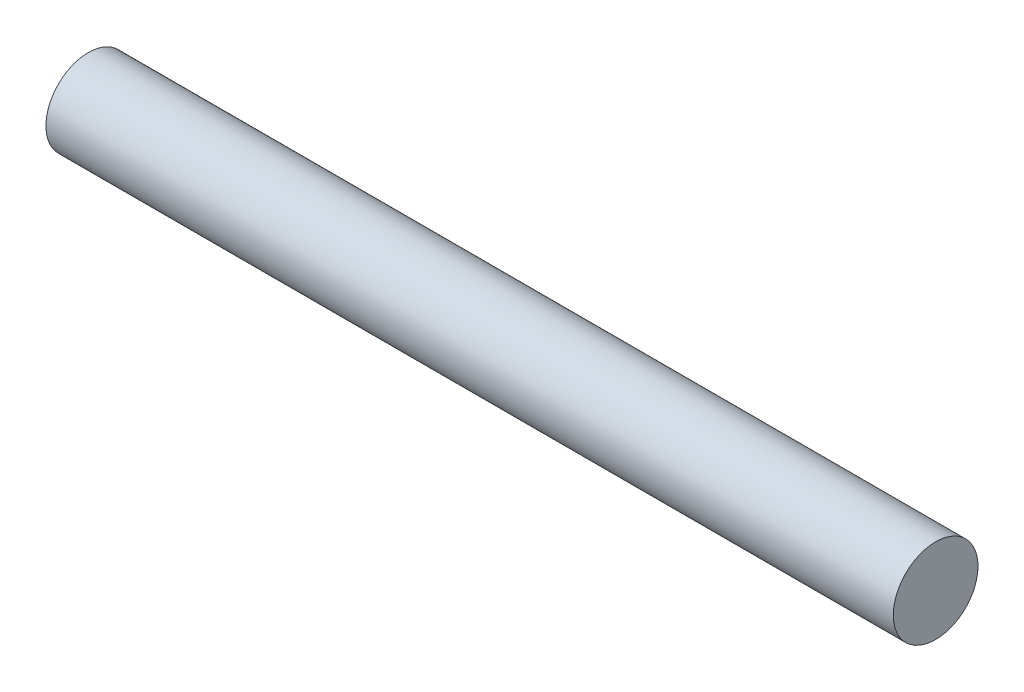
ISO-10303-21;
HEADER;
FILE_DESCRIPTION(('STEP AP214'),'2;1');
FILE_NAME('part.step','',(''),(''),'','','');
FILE_SCHEMA(('AUTOMOTIVE_DESIGN { 1 0 10303 214 1 1 1 1 }'));
ENDSEC;
DATA;
#1=APPLICATION_CONTEXT('core data for automotive mechanical design processes');
#2=APPLICATION_PROTOCOL_DEFINITION('international standard','automotive_design',2000,#1);
#3=PRODUCT_CONTEXT('',#1,'mechanical');
#4=PRODUCT('Part','Part','',(#3));
#5=PRODUCT_RELATED_PRODUCT_CATEGORY('part','',(#4));
#6=PRODUCT_DEFINITION_FORMATION('','',#4);
#7=PRODUCT_DEFINITION_CONTEXT('part definition',#1,'design');
#8=PRODUCT_DEFINITION('design','',#6,#7);
#9=PRODUCT_DEFINITION_SHAPE('','',#8);
#10=(LENGTH_UNIT() NAMED_UNIT(*) SI_UNIT(.MILLI.,.METRE.));
#11=(NAMED_UNIT(*) PLANE_ANGLE_UNIT() SI_UNIT($,.RADIAN.));
#12=(NAMED_UNIT(*) SI_UNIT($,.STERADIAN.) SOLID_ANGLE_UNIT());
#13=UNCERTAINTY_MEASURE_WITH_UNIT(LENGTH_MEASURE(1.E-05),#10,'distance_accuracy_value','');
#14=(GEOMETRIC_REPRESENTATION_CONTEXT(3) GLOBAL_UNCERTAINTY_ASSIGNED_CONTEXT((#13)) GLOBAL_UNIT_ASSIGNED_CONTEXT((#10,
#11,#12)) REPRESENTATION_CONTEXT('',''));
#15=CARTESIAN_POINT('',(0.,0.,0.));
#16=DIRECTION('',(0.,0.,1.));
#17=DIRECTION('',(1.,0.,0.));
#18=AXIS2_PLACEMENT_3D('',#15,#16,#17);
#19=CARTESIAN_POINT('',(31.75,0.,0.));
#20=DIRECTION('',(-1.,0.,0.));
#21=DIRECTION('',(0.,0.,1.));
#22=AXIS2_PLACEMENT_3D('',#19,#20,#21);
#23=CYLINDRICAL_SURFACE('',#22,3.175);
#24=CARTESIAN_POINT('',(31.75,0.,0.));
#25=DIRECTION('',(1.,0.,0.));
#26=DIRECTION('',(0.,0.,-1.));
#27=AXIS2_PLACEMENT_3D('',#24,#25,#26);
#28=CIRCLE('',#27,3.175);
#29=CARTESIAN_POINT('',(31.75,0.,-3.175));
#30=VERTEX_POINT('',#29);
#31=EDGE_CURVE('E10',#30,#30,#28,.T.);
#32=ORIENTED_EDGE('',*,*,#31,.F.);
#33=EDGE_LOOP('',(#32));
#34=FACE_BOUND('',#33,.T.);
#35=CARTESIAN_POINT('',(-31.75,0.,0.));
#36=DIRECTION('',(1.,0.,0.));
#37=DIRECTION('',(0.,0.,-1.));
#38=AXIS2_PLACEMENT_3D('',#35,#36,#37);
#39=CIRCLE('',#38,3.175);
#40=CARTESIAN_POINT('',(-31.75,0.,-3.175));
#41=VERTEX_POINT('',#40);
#42=EDGE_CURVE('E37',#41,#41,#39,.T.);
#43=ORIENTED_EDGE('',*,*,#42,.T.);
#44=EDGE_LOOP('',(#43));
#45=FACE_BOUND('',#44,.T.);
#46=ADVANCED_FACE('F34',(#34,#45),#23,.T.);
#47=CARTESIAN_POINT('',(31.75,0.,0.));
#48=DIRECTION('',(1.,0.,0.));
#49=DIRECTION('',(0.,0.,-1.));
#50=AXIS2_PLACEMENT_3D('',#47,#48,#49);
#51=PLANE('',#50);
#52=ORIENTED_EDGE('',*,*,#31,.T.);
#53=EDGE_LOOP('',(#52));
#54=FACE_BOUND('',#53,.T.);
#55=ADVANCED_FACE('F49',(#54),#51,.T.);
#56=CARTESIAN_POINT('',(-31.75,0.,0.));
#57=DIRECTION('',(1.,0.,0.));
#58=DIRECTION('',(0.,0.,-1.));
#59=AXIS2_PLACEMENT_3D('',#56,#57,#58);
#60=PLANE('',#59);
#61=ORIENTED_EDGE('',*,*,#42,.F.);
#62=EDGE_LOOP('',(#61));
#63=FACE_BOUND('',#62,.T.);
#64=ADVANCED_FACE('F47',(#63),#60,.F.);
#65=CLOSED_SHELL('',(#46,#55,#64));
#66=MANIFOLD_SOLID_BREP('B2',#65);
#67=ADVANCED_BREP_SHAPE_REPRESENTATION('',(#18,#66),#14);
#68=SHAPE_DEFINITION_REPRESENTATION(#9,#67);
ENDSEC;
END-ISO-10303-21;
